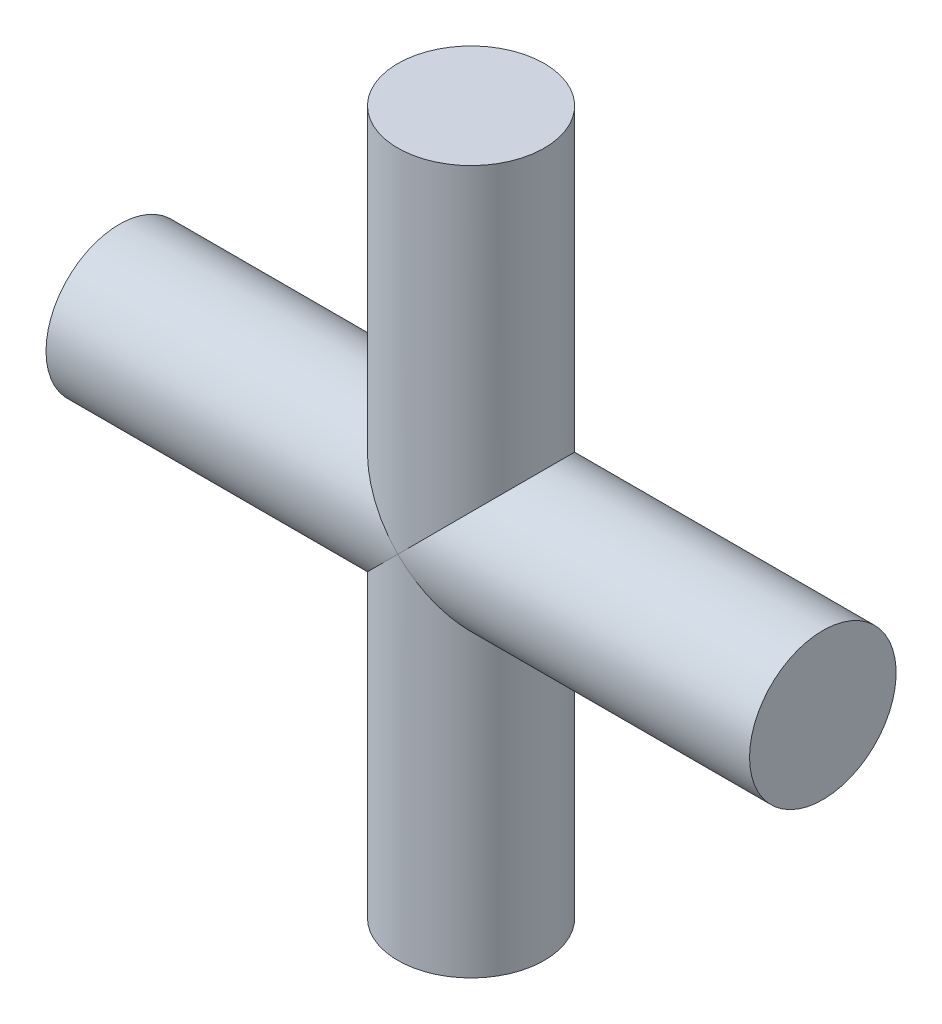
ISO-10303-21;
HEADER;
FILE_DESCRIPTION(('STEP AP214'),'2;1');
FILE_NAME('part.step','',(''),(''),'','','');
FILE_SCHEMA(('AUTOMOTIVE_DESIGN { 1 0 10303 214 1 1 1 1 }'));
ENDSEC;
DATA;
#1=APPLICATION_CONTEXT('core data for automotive mechanical design processes');
#2=APPLICATION_PROTOCOL_DEFINITION('international standard','automotive_design',2000,#1);
#3=PRODUCT_CONTEXT('',#1,'mechanical');
#4=PRODUCT('Part','Part','',(#3));
#5=PRODUCT_RELATED_PRODUCT_CATEGORY('part','',(#4));
#6=PRODUCT_DEFINITION_FORMATION('','',#4);
#7=PRODUCT_DEFINITION_CONTEXT('part definition',#1,'design');
#8=PRODUCT_DEFINITION('design','',#6,#7);
#9=PRODUCT_DEFINITION_SHAPE('','',#8);
#10=(LENGTH_UNIT() NAMED_UNIT(*) SI_UNIT(.MILLI.,.METRE.));
#11=(NAMED_UNIT(*) PLANE_ANGLE_UNIT() SI_UNIT($,.RADIAN.));
#12=(NAMED_UNIT(*) SI_UNIT($,.STERADIAN.) SOLID_ANGLE_UNIT());
#13=UNCERTAINTY_MEASURE_WITH_UNIT(LENGTH_MEASURE(1.E-05),#10,'distance_accuracy_value','');
#14=(GEOMETRIC_REPRESENTATION_CONTEXT(3) GLOBAL_UNCERTAINTY_ASSIGNED_CONTEXT((#13)) GLOBAL_UNIT_ASSIGNED_CONTEXT((#10,
#11,#12)) REPRESENTATION_CONTEXT('',''));
#15=CARTESIAN_POINT('',(0.,0.,0.));
#16=DIRECTION('',(0.,0.,1.));
#17=DIRECTION('',(1.,0.,0.));
#18=AXIS2_PLACEMENT_3D('',#15,#16,#17);
#19=CARTESIAN_POINT('',(1.2,0.,0.));
#20=DIRECTION('',(1.,0.,0.));
#21=DIRECTION('',(0.,0.,-1.));
#22=AXIS2_PLACEMENT_3D('',#19,#20,#21);
#23=PLANE('',#22);
#24=CARTESIAN_POINT('',(1.2,0.,0.));
#25=DIRECTION('',(-1.,0.,0.));
#26=DIRECTION('',(0.,0.,1.));
#27=AXIS2_PLACEMENT_3D('',#24,#25,#26);
#28=CIRCLE('',#27,0.25);
#29=CARTESIAN_POINT('',(1.2,0.,0.25));
#30=VERTEX_POINT('',#29);
#31=EDGE_CURVE('E65',#30,#30,#28,.T.);
#32=ORIENTED_EDGE('',*,*,#31,.F.);
#33=EDGE_LOOP('',(#32));
#34=FACE_BOUND('',#33,.T.);
#35=ADVANCED_FACE('F37',(#34),#23,.T.);
#36=CARTESIAN_POINT('',(-1.2,0.,0.));
#37=DIRECTION('',(-1.,0.,0.));
#38=DIRECTION('',(0.,0.,1.));
#39=AXIS2_PLACEMENT_3D('',#36,#37,#38);
#40=CYLINDRICAL_SURFACE('',#39,0.25);
#41=CARTESIAN_POINT('',(0.,0.,0.));
#42=DIRECTION('',(-0.707106781186547,-0.707106781186547,0.));
#43=DIRECTION('',(-0.707106781186547,0.707106781186547,0.));
#44=AXIS2_PLACEMENT_3D('',#41,#42,#43);
#45=ELLIPSE('',#44,0.353553390593274,0.25);
#46=CARTESIAN_POINT('',(0.,0.,-0.25));
#47=VERTEX_POINT('',#46);
#48=CARTESIAN_POINT('',(0.,0.,0.25));
#49=VERTEX_POINT('',#48);
#50=EDGE_CURVE('E45',#47,#49,#45,.T.);
#51=ORIENTED_EDGE('',*,*,#50,.F.);
#52=CARTESIAN_POINT('',(0.,0.,0.));
#53=DIRECTION('',(-0.707106781186547,0.707106781186547,0.));
#54=DIRECTION('',(-0.707106781186547,-0.707106781186547,0.));
#55=AXIS2_PLACEMENT_3D('',#52,#53,#54);
#56=ELLIPSE('',#55,0.353553390593274,0.25);
#57=EDGE_CURVE('E57',#49,#47,#56,.T.);
#58=ORIENTED_EDGE('',*,*,#57,.F.);
#59=EDGE_LOOP('',(#51,#58));
#60=FACE_BOUND('',#59,.T.);
#61=ORIENTED_EDGE('',*,*,#31,.T.);
#62=EDGE_LOOP('',(#61));
#63=FACE_BOUND('',#62,.T.);
#64=ADVANCED_FACE('F58',(#60,#63),#40,.T.);
#65=CARTESIAN_POINT('',(0.25,-1.2,0.));
#66=DIRECTION('',(0.,-1.,0.));
#67=DIRECTION('',(0.,0.,-1.));
#68=AXIS2_PLACEMENT_3D('',#65,#66,#67);
#69=PLANE('',#68);
#70=CARTESIAN_POINT('',(0.,-1.2,0.));
#71=DIRECTION('',(0.,-1.,0.));
#72=DIRECTION('',(0.,0.,-1.));
#73=AXIS2_PLACEMENT_3D('',#70,#71,#72);
#74=CIRCLE('',#73,0.25);
#75=CARTESIAN_POINT('',(0.,-1.2,-0.25));
#76=VERTEX_POINT('',#75);
#77=EDGE_CURVE('E78',#76,#76,#74,.T.);
#78=ORIENTED_EDGE('',*,*,#77,.T.);
#79=EDGE_LOOP('',(#78));
#80=FACE_BOUND('',#79,.T.);
#81=ADVANCED_FACE('F92',(#80),#69,.T.);
#82=CARTESIAN_POINT('',(0.,0.,0.));
#83=DIRECTION('',(0.,-1.,0.));
#84=DIRECTION('',(0.,0.,-1.));
#85=AXIS2_PLACEMENT_3D('',#82,#83,#84);
#86=CYLINDRICAL_SURFACE('',#85,0.25);
#87=ORIENTED_EDGE('',*,*,#77,.F.);
#88=EDGE_LOOP('',(#87));
#89=FACE_BOUND('',#88,.T.);
#90=CARTESIAN_POINT('',(0.,0.,0.));
#91=DIRECTION('',(-0.707106781186547,0.707106781186547,0.));
#92=DIRECTION('',(-0.707106781186547,-0.707106781186547,0.));
#93=AXIS2_PLACEMENT_3D('',#90,#91,#92);
#94=ELLIPSE('',#93,0.353553390593274,0.25);
#95=EDGE_CURVE('E51',#49,#47,#94,.F.);
#96=ORIENTED_EDGE('',*,*,#95,.T.);
#97=ORIENTED_EDGE('',*,*,#50,.T.);
#98=EDGE_LOOP('',(#96,#97));
#99=FACE_BOUND('',#98,.T.);
#100=ADVANCED_FACE('F67',(#89,#99),#86,.T.);
#101=CARTESIAN_POINT('',(-1.2,0.,0.25));
#102=DIRECTION('',(-1.,0.,0.));
#103=DIRECTION('',(0.,0.,1.));
#104=AXIS2_PLACEMENT_3D('',#101,#102,#103);
#105=PLANE('',#104);
#106=CARTESIAN_POINT('',(-1.2,0.,0.));
#107=DIRECTION('',(-1.,0.,0.));
#108=DIRECTION('',(0.,0.,1.));
#109=AXIS2_PLACEMENT_3D('',#106,#107,#108);
#110=CIRCLE('',#109,0.25);
#111=CARTESIAN_POINT('',(-1.2,0.,0.25));
#112=VERTEX_POINT('',#111);
#113=EDGE_CURVE('E77',#112,#112,#110,.T.);
#114=ORIENTED_EDGE('',*,*,#113,.T.);
#115=EDGE_LOOP('',(#114));
#116=FACE_BOUND('',#115,.T.);
#117=ADVANCED_FACE('F39',(#116),#105,.T.);
#118=CARTESIAN_POINT('',(0.,0.,0.));
#119=DIRECTION('',(-0.707106781186547,-0.707106781186547,0.));
#120=DIRECTION('',(-0.707106781186547,0.707106781186547,0.));
#121=AXIS2_PLACEMENT_3D('',#118,#119,#120);
#122=ELLIPSE('',#121,0.353553390593274,0.25);
#123=EDGE_CURVE('E11',#47,#49,#122,.F.);
#124=ORIENTED_EDGE('',*,*,#123,.F.);
#125=ORIENTED_EDGE('',*,*,#95,.F.);
#126=EDGE_LOOP('',(#124,#125));
#127=FACE_BOUND('',#126,.T.);
#128=ORIENTED_EDGE('',*,*,#113,.F.);
#129=EDGE_LOOP('',(#128));
#130=FACE_BOUND('',#129,.T.);
#131=ADVANCED_FACE('F63',(#127,#130),#40,.T.);
#132=CARTESIAN_POINT('',(0.,1.2,0.));
#133=DIRECTION('',(0.,1.,0.));
#134=DIRECTION('',(0.,0.,1.));
#135=AXIS2_PLACEMENT_3D('',#132,#133,#134);
#136=PLANE('',#135);
#137=CARTESIAN_POINT('',(0.,1.2,0.));
#138=DIRECTION('',(0.,-1.,0.));
#139=DIRECTION('',(0.,0.,-1.));
#140=AXIS2_PLACEMENT_3D('',#137,#138,#139);
#141=CIRCLE('',#140,0.25);
#142=CARTESIAN_POINT('',(0.,1.2,-0.25));
#143=VERTEX_POINT('',#142);
#144=EDGE_CURVE('E75',#143,#143,#141,.T.);
#145=ORIENTED_EDGE('',*,*,#144,.F.);
#146=EDGE_LOOP('',(#145));
#147=FACE_BOUND('',#146,.T.);
#148=ADVANCED_FACE('F71',(#147),#136,.T.);
#149=ORIENTED_EDGE('',*,*,#57,.T.);
#150=ORIENTED_EDGE('',*,*,#123,.T.);
#151=EDGE_LOOP('',(#149,#150));
#152=FACE_BOUND('',#151,.T.);
#153=ORIENTED_EDGE('',*,*,#144,.T.);
#154=EDGE_LOOP('',(#153));
#155=FACE_BOUND('',#154,.T.);
#156=ADVANCED_FACE('F68',(#152,#155),#86,.T.);
#157=CLOSED_SHELL('',(#35,#64,#81,#100,#117,#131,#148,#156));
#158=MANIFOLD_SOLID_BREP('B2',#157);
#159=ADVANCED_BREP_SHAPE_REPRESENTATION('',(#18,#158),#14);
#160=SHAPE_DEFINITION_REPRESENTATION(#9,#159);
ENDSEC;
END-ISO-10303-21;
